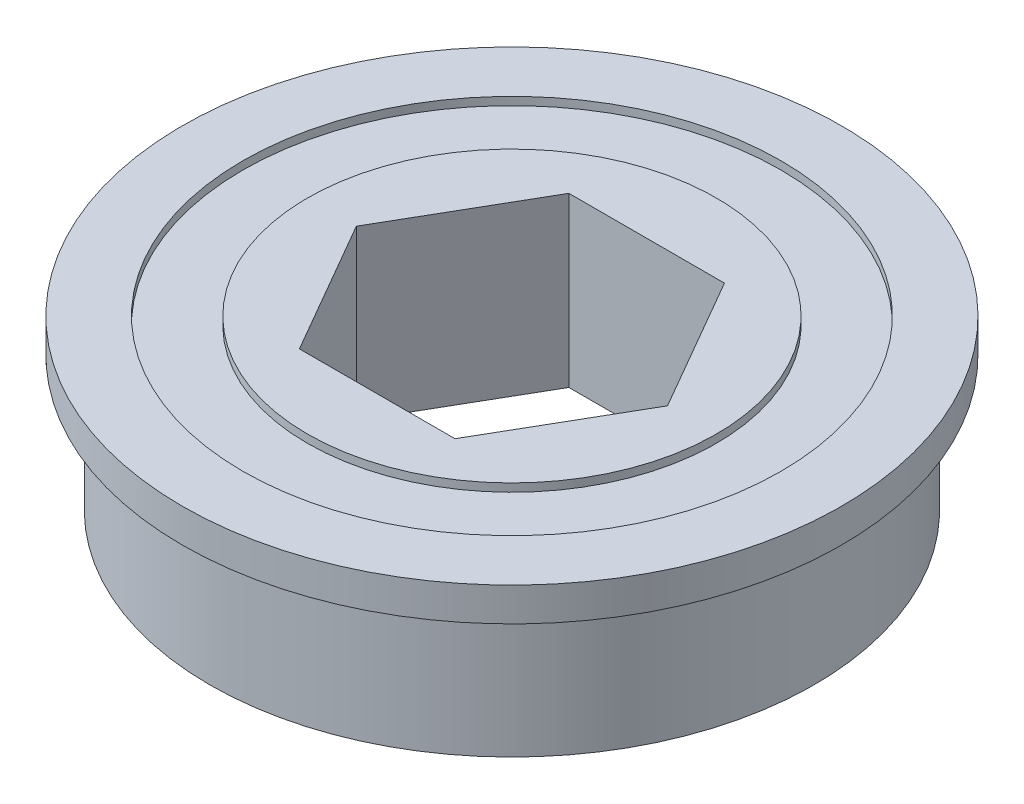
ISO-10303-21;
HEADER;
FILE_DESCRIPTION(('STEP AP214'),'2;1');
FILE_NAME('part.step','',(''),(''),'','','');
FILE_SCHEMA(('AUTOMOTIVE_DESIGN { 1 0 10303 214 1 1 1 1 }'));
ENDSEC;
DATA;
#1=APPLICATION_CONTEXT('core data for automotive mechanical design processes');
#2=APPLICATION_PROTOCOL_DEFINITION('international standard','automotive_design',2000,#1);
#3=PRODUCT_CONTEXT('',#1,'mechanical');
#4=PRODUCT('Part','Part','',(#3));
#5=PRODUCT_RELATED_PRODUCT_CATEGORY('part','',(#4));
#6=PRODUCT_DEFINITION_FORMATION('','',#4);
#7=PRODUCT_DEFINITION_CONTEXT('part definition',#1,'design');
#8=PRODUCT_DEFINITION('design','',#6,#7);
#9=PRODUCT_DEFINITION_SHAPE('','',#8);
#10=(LENGTH_UNIT() NAMED_UNIT(*) SI_UNIT(.MILLI.,.METRE.));
#11=(NAMED_UNIT(*) PLANE_ANGLE_UNIT() SI_UNIT($,.RADIAN.));
#12=(NAMED_UNIT(*) SI_UNIT($,.STERADIAN.) SOLID_ANGLE_UNIT());
#13=UNCERTAINTY_MEASURE_WITH_UNIT(LENGTH_MEASURE(1.E-05),#10,'distance_accuracy_value','');
#14=(GEOMETRIC_REPRESENTATION_CONTEXT(3) GLOBAL_UNCERTAINTY_ASSIGNED_CONTEXT((#13)) GLOBAL_UNIT_ASSIGNED_CONTEXT((#10,
#11,#12)) REPRESENTATION_CONTEXT('',''));
#15=CARTESIAN_POINT('',(0.,0.,0.));
#16=DIRECTION('',(0.,0.,1.));
#17=DIRECTION('',(1.,0.,0.));
#18=AXIS2_PLACEMENT_3D('',#15,#16,#17);
#19=CARTESIAN_POINT('',(0.,0.,0.));
#20=DIRECTION('',(0.,1.,0.));
#21=DIRECTION('',(0.,0.,1.));
#22=AXIS2_PLACEMENT_3D('',#19,#20,#21);
#23=CYLINDRICAL_SURFACE('',#22,9.652);
#24=CARTESIAN_POINT('',(0.,7.5565,0.));
#25=DIRECTION('',(0.,1.,0.));
#26=DIRECTION('',(0.,0.,1.));
#27=AXIS2_PLACEMENT_3D('',#24,#25,#26);
#28=CIRCLE('',#27,9.652);
#29=CARTESIAN_POINT('',(0.,7.5565,9.652));
#30=VERTEX_POINT('',#29);
#31=EDGE_CURVE('E10',#30,#30,#28,.T.);
#32=ORIENTED_EDGE('',*,*,#31,.T.);
#33=EDGE_LOOP('',(#32));
#34=FACE_BOUND('',#33,.T.);
#35=CARTESIAN_POINT('',(0.,7.9375,0.));
#36=DIRECTION('',(0.,1.,0.));
#37=DIRECTION('',(0.,0.,1.));
#38=AXIS2_PLACEMENT_3D('',#35,#36,#37);
#39=CIRCLE('',#38,9.652);
#40=CARTESIAN_POINT('',(0.,7.9375,9.652));
#41=VERTEX_POINT('',#40);
#42=EDGE_CURVE('E113',#41,#41,#39,.T.);
#43=ORIENTED_EDGE('',*,*,#42,.F.);
#44=EDGE_LOOP('',(#43));
#45=FACE_BOUND('',#44,.T.);
#46=ADVANCED_FACE('F16',(#34,#45),#23,.T.);
#47=CARTESIAN_POINT('',(9.652,7.5565,0.));
#48=DIRECTION('',(0.,1.,0.));
#49=DIRECTION('',(0.,0.,1.));
#50=AXIS2_PLACEMENT_3D('',#47,#48,#49);
#51=PLANE('',#50);
#52=CARTESIAN_POINT('',(0.,7.5565,0.));
#53=DIRECTION('',(0.,1.,0.));
#54=DIRECTION('',(0.,0.,1.));
#55=AXIS2_PLACEMENT_3D('',#52,#53,#54);
#56=CIRCLE('',#55,12.7);
#57=CARTESIAN_POINT('',(0.,7.5565,12.7));
#58=VERTEX_POINT('',#57);
#59=EDGE_CURVE('E23',#58,#58,#56,.T.);
#60=ORIENTED_EDGE('',*,*,#59,.T.);
#61=EDGE_LOOP('',(#60));
#62=FACE_BOUND('',#61,.T.);
#63=ORIENTED_EDGE('',*,*,#31,.F.);
#64=EDGE_LOOP('',(#63));
#65=FACE_BOUND('',#64,.T.);
#66=ADVANCED_FACE('F158',(#62,#65),#51,.T.);
#67=CARTESIAN_POINT('',(0.,0.,0.));
#68=DIRECTION('',(0.,1.,0.));
#69=DIRECTION('',(0.,0.,1.));
#70=AXIS2_PLACEMENT_3D('',#67,#68,#69);
#71=CYLINDRICAL_SURFACE('',#70,12.7);
#72=CARTESIAN_POINT('',(0.,7.9375,0.));
#73=DIRECTION('',(0.,1.,0.));
#74=DIRECTION('',(0.,0.,1.));
#75=AXIS2_PLACEMENT_3D('',#72,#73,#74);
#76=CIRCLE('',#75,12.7);
#77=CARTESIAN_POINT('',(0.,7.9375,12.7));
#78=VERTEX_POINT('',#77);
#79=EDGE_CURVE('E153',#78,#78,#76,.T.);
#80=ORIENTED_EDGE('',*,*,#79,.T.);
#81=EDGE_LOOP('',(#80));
#82=FACE_BOUND('',#81,.T.);
#83=ORIENTED_EDGE('',*,*,#59,.F.);
#84=EDGE_LOOP('',(#83));
#85=FACE_BOUND('',#84,.T.);
#86=ADVANCED_FACE('F161',(#82,#85),#71,.F.);
#87=CARTESIAN_POINT('',(12.7,7.9375,0.));
#88=DIRECTION('',(0.,1.,0.));
#89=DIRECTION('',(0.,0.,1.));
#90=AXIS2_PLACEMENT_3D('',#87,#88,#89);
#91=PLANE('',#90);
#92=CARTESIAN_POINT('',(0.,7.9375,0.));
#93=DIRECTION('',(0.,1.,0.));
#94=DIRECTION('',(0.,0.,1.));
#95=AXIS2_PLACEMENT_3D('',#92,#93,#94);
#96=CIRCLE('',#95,15.5575);
#97=CARTESIAN_POINT('',(0.,7.9375,15.5575));
#98=VERTEX_POINT('',#97);
#99=EDGE_CURVE('E150',#98,#98,#96,.T.);
#100=ORIENTED_EDGE('',*,*,#99,.T.);
#101=EDGE_LOOP('',(#100));
#102=FACE_BOUND('',#101,.T.);
#103=ORIENTED_EDGE('',*,*,#79,.F.);
#104=EDGE_LOOP('',(#103));
#105=FACE_BOUND('',#104,.T.);
#106=ADVANCED_FACE('F163',(#102,#105),#91,.T.);
#107=CARTESIAN_POINT('',(0.,0.,0.));
#108=DIRECTION('',(0.,1.,0.));
#109=DIRECTION('',(0.,0.,1.));
#110=AXIS2_PLACEMENT_3D('',#107,#108,#109);
#111=CYLINDRICAL_SURFACE('',#110,15.5575);
#112=CARTESIAN_POINT('',(0.,6.35,0.));
#113=DIRECTION('',(0.,1.,0.));
#114=DIRECTION('',(0.,0.,1.));
#115=AXIS2_PLACEMENT_3D('',#112,#113,#114);
#116=CIRCLE('',#115,15.5575);
#117=CARTESIAN_POINT('',(0.,6.35,15.5575));
#118=VERTEX_POINT('',#117);
#119=EDGE_CURVE('E147',#118,#118,#116,.T.);
#120=ORIENTED_EDGE('',*,*,#119,.T.);
#121=EDGE_LOOP('',(#120));
#122=FACE_BOUND('',#121,.T.);
#123=ORIENTED_EDGE('',*,*,#99,.F.);
#124=EDGE_LOOP('',(#123));
#125=FACE_BOUND('',#124,.T.);
#126=ADVANCED_FACE('F172',(#122,#125),#111,.T.);
#127=CARTESIAN_POINT('',(15.5575,6.35,0.));
#128=DIRECTION('',(0.,-1.,0.));
#129=DIRECTION('',(0.,0.,-1.));
#130=AXIS2_PLACEMENT_3D('',#127,#128,#129);
#131=PLANE('',#130);
#132=CARTESIAN_POINT('',(0.,6.35,0.));
#133=DIRECTION('',(0.,1.,0.));
#134=DIRECTION('',(0.,0.,1.));
#135=AXIS2_PLACEMENT_3D('',#132,#133,#134);
#136=CIRCLE('',#135,14.2748);
#137=CARTESIAN_POINT('',(0.,6.35,14.2748));
#138=VERTEX_POINT('',#137);
#139=EDGE_CURVE('E144',#138,#138,#136,.T.);
#140=ORIENTED_EDGE('',*,*,#139,.T.);
#141=EDGE_LOOP('',(#140));
#142=FACE_BOUND('',#141,.T.);
#143=ORIENTED_EDGE('',*,*,#119,.F.);
#144=EDGE_LOOP('',(#143));
#145=FACE_BOUND('',#144,.T.);
#146=ADVANCED_FACE('F226',(#142,#145),#131,.T.);
#147=CARTESIAN_POINT('',(0.,6.1,0.));
#148=DIRECTION('',(0.,1.,0.));
#149=DIRECTION('',(0.,0.,1.));
#150=AXIS2_PLACEMENT_3D('',#147,#148,#149);
#151=TOROIDAL_SURFACE('',#150,14.2748,0.25);
#152=CARTESIAN_POINT('',(0.,5.975,0.));
#153=DIRECTION('',(0.,1.,0.));
#154=DIRECTION('',(0.,0.,1.));
#155=AXIS2_PLACEMENT_3D('',#152,#153,#154);
#156=CIRCLE('',#155,14.0582936490539);
#157=CARTESIAN_POINT('',(0.,5.975,14.0582936490539));
#158=VERTEX_POINT('',#157);
#159=EDGE_CURVE('E141',#158,#158,#156,.T.);
#160=ORIENTED_EDGE('',*,*,#159,.T.);
#161=EDGE_LOOP('',(#160));
#162=FACE_BOUND('',#161,.T.);
#163=ORIENTED_EDGE('',*,*,#139,.F.);
#164=EDGE_LOOP('',(#163));
#165=FACE_BOUND('',#164,.T.);
#166=ADVANCED_FACE('F222',(#162,#165),#151,.F.);
#167=CARTESIAN_POINT('',(0.,5.975,0.));
#168=DIRECTION('',(0.,-1.,0.));
#169=DIRECTION('',(0.,0.,-1.));
#170=AXIS2_PLACEMENT_3D('',#167,#168,#169);
#171=CONICAL_SURFACE('',#170,14.0582936490539,0.523598775598298);
#172=CARTESIAN_POINT('',(0.,5.6,0.));
#173=DIRECTION('',(0.,1.,0.));
#174=DIRECTION('',(0.,0.,1.));
#175=AXIS2_PLACEMENT_3D('',#172,#173,#174);
#176=CIRCLE('',#175,14.2748);
#177=CARTESIAN_POINT('',(0.,5.6,14.2748));
#178=VERTEX_POINT('',#177);
#179=EDGE_CURVE('E138',#178,#178,#176,.T.);
#180=ORIENTED_EDGE('',*,*,#179,.T.);
#181=EDGE_LOOP('',(#180));
#182=FACE_BOUND('',#181,.T.);
#183=ORIENTED_EDGE('',*,*,#159,.F.);
#184=EDGE_LOOP('',(#183));
#185=FACE_BOUND('',#184,.T.);
#186=ADVANCED_FACE('F218',(#182,#185),#171,.T.);
#187=CARTESIAN_POINT('',(0.,0.,0.));
#188=DIRECTION('',(0.,1.,0.));
#189=DIRECTION('',(0.,0.,1.));
#190=AXIS2_PLACEMENT_3D('',#187,#188,#189);
#191=CYLINDRICAL_SURFACE('',#190,14.2748);
#192=CARTESIAN_POINT('',(0.,0.,0.));
#193=DIRECTION('',(0.,1.,0.));
#194=DIRECTION('',(0.,0.,1.));
#195=AXIS2_PLACEMENT_3D('',#192,#193,#194);
#196=CIRCLE('',#195,14.2748);
#197=CARTESIAN_POINT('',(0.,0.,14.2748));
#198=VERTEX_POINT('',#197);
#199=EDGE_CURVE('E135',#198,#198,#196,.T.);
#200=ORIENTED_EDGE('',*,*,#199,.T.);
#201=EDGE_LOOP('',(#200));
#202=FACE_BOUND('',#201,.T.);
#203=ORIENTED_EDGE('',*,*,#179,.F.);
#204=EDGE_LOOP('',(#203));
#205=FACE_BOUND('',#204,.T.);
#206=ADVANCED_FACE('F214',(#202,#205),#191,.T.);
#207=CARTESIAN_POINT('',(14.2748,0.,0.));
#208=DIRECTION('',(0.,-1.,0.));
#209=DIRECTION('',(0.,0.,-1.));
#210=AXIS2_PLACEMENT_3D('',#207,#208,#209);
#211=PLANE('',#210);
#212=CARTESIAN_POINT('',(0.,0.,0.));
#213=DIRECTION('',(0.,1.,0.));
#214=DIRECTION('',(0.,0.,1.));
#215=AXIS2_PLACEMENT_3D('',#212,#213,#214);
#216=CIRCLE('',#215,12.7);
#217=CARTESIAN_POINT('',(0.,0.,12.7));
#218=VERTEX_POINT('',#217);
#219=EDGE_CURVE('E132',#218,#218,#216,.T.);
#220=ORIENTED_EDGE('',*,*,#219,.T.);
#221=EDGE_LOOP('',(#220));
#222=FACE_BOUND('',#221,.T.);
#223=ORIENTED_EDGE('',*,*,#199,.F.);
#224=EDGE_LOOP('',(#223));
#225=FACE_BOUND('',#224,.T.);
#226=ADVANCED_FACE('F210',(#222,#225),#211,.T.);
#227=CARTESIAN_POINT('',(0.,0.,0.));
#228=DIRECTION('',(0.,1.,0.));
#229=DIRECTION('',(0.,0.,1.));
#230=AXIS2_PLACEMENT_3D('',#227,#228,#229);
#231=CYLINDRICAL_SURFACE('',#230,12.7);
#232=CARTESIAN_POINT('',(0.,0.381,0.));
#233=DIRECTION('',(0.,1.,0.));
#234=DIRECTION('',(0.,0.,1.));
#235=AXIS2_PLACEMENT_3D('',#232,#233,#234);
#236=CIRCLE('',#235,12.7);
#237=CARTESIAN_POINT('',(0.,0.381,12.7));
#238=VERTEX_POINT('',#237);
#239=EDGE_CURVE('E129',#238,#238,#236,.T.);
#240=ORIENTED_EDGE('',*,*,#239,.T.);
#241=EDGE_LOOP('',(#240));
#242=FACE_BOUND('',#241,.T.);
#243=ORIENTED_EDGE('',*,*,#219,.F.);
#244=EDGE_LOOP('',(#243));
#245=FACE_BOUND('',#244,.T.);
#246=ADVANCED_FACE('F206',(#242,#245),#231,.F.);
#247=CARTESIAN_POINT('',(9.652,0.381,0.));
#248=DIRECTION('',(0.,-1.,0.));
#249=DIRECTION('',(0.,0.,-1.));
#250=AXIS2_PLACEMENT_3D('',#247,#248,#249);
#251=PLANE('',#250);
#252=CARTESIAN_POINT('',(0.,0.381,0.));
#253=DIRECTION('',(0.,1.,0.));
#254=DIRECTION('',(0.,0.,1.));
#255=AXIS2_PLACEMENT_3D('',#252,#253,#254);
#256=CIRCLE('',#255,9.652);
#257=CARTESIAN_POINT('',(0.,0.381,9.652));
#258=VERTEX_POINT('',#257);
#259=EDGE_CURVE('E126',#258,#258,#256,.T.);
#260=ORIENTED_EDGE('',*,*,#259,.T.);
#261=EDGE_LOOP('',(#260));
#262=FACE_BOUND('',#261,.T.);
#263=ORIENTED_EDGE('',*,*,#239,.F.);
#264=EDGE_LOOP('',(#263));
#265=FACE_BOUND('',#264,.T.);
#266=ADVANCED_FACE('F202',(#262,#265),#251,.T.);
#267=CARTESIAN_POINT('',(0.,0.,0.));
#268=DIRECTION('',(0.,1.,0.));
#269=DIRECTION('',(0.,0.,1.));
#270=AXIS2_PLACEMENT_3D('',#267,#268,#269);
#271=CYLINDRICAL_SURFACE('',#270,9.652);
#272=CARTESIAN_POINT('',(0.,0.,0.));
#273=DIRECTION('',(0.,1.,0.));
#274=DIRECTION('',(0.,0.,1.));
#275=AXIS2_PLACEMENT_3D('',#272,#273,#274);
#276=CIRCLE('',#275,9.652);
#277=CARTESIAN_POINT('',(0.,0.,9.652));
#278=VERTEX_POINT('',#277);
#279=EDGE_CURVE('E123',#278,#278,#276,.T.);
#280=ORIENTED_EDGE('',*,*,#279,.T.);
#281=EDGE_LOOP('',(#280));
#282=FACE_BOUND('',#281,.T.);
#283=ORIENTED_EDGE('',*,*,#259,.F.);
#284=EDGE_LOOP('',(#283));
#285=FACE_BOUND('',#284,.T.);
#286=ADVANCED_FACE('F196',(#282,#285),#271,.T.);
#287=CARTESIAN_POINT('',(9.652,0.,0.));
#288=DIRECTION('',(0.,-1.,0.));
#289=DIRECTION('',(0.,0.,-1.));
#290=AXIS2_PLACEMENT_3D('',#287,#288,#289);
#291=PLANE('',#290);
#292=DIRECTION('',(-0.5,0.,-0.866025403784439));
#293=VECTOR('',#292,1.);
#294=CARTESIAN_POINT('',(7.34389542409204,0.,0.));
#295=LINE('',#294,#293);
#296=CARTESIAN_POINT('',(7.34389542409204,0.,0.));
#297=VERTEX_POINT('',#296);
#298=CARTESIAN_POINT('',(3.67194771204602,0.,-6.36));
#299=VERTEX_POINT('',#298);
#300=EDGE_CURVE('E70',#297,#299,#295,.T.);
#301=ORIENTED_EDGE('',*,*,#300,.T.);
#302=DIRECTION('',(-1.,0.,0.));
#303=VECTOR('',#302,1.);
#304=CARTESIAN_POINT('',(3.67194771204602,0.,-6.36));
#305=LINE('',#304,#303);
#306=CARTESIAN_POINT('',(-3.67194771204602,0.,-6.36));
#307=VERTEX_POINT('',#306);
#308=EDGE_CURVE('E79',#299,#307,#305,.T.);
#309=ORIENTED_EDGE('',*,*,#308,.T.);
#310=DIRECTION('',(-0.5,0.,0.866025403784439));
#311=VECTOR('',#310,1.);
#312=CARTESIAN_POINT('',(-3.67194771204602,0.,-6.36));
#313=LINE('',#312,#311);
#314=CARTESIAN_POINT('',(-7.34389542409204,0.,0.));
#315=VERTEX_POINT('',#314);
#316=EDGE_CURVE('E30',#307,#315,#313,.T.);
#317=ORIENTED_EDGE('',*,*,#316,.T.);
#318=DIRECTION('',(0.5,0.,0.866025403784439));
#319=VECTOR('',#318,1.);
#320=CARTESIAN_POINT('',(-7.34389542409204,0.,0.));
#321=LINE('',#320,#319);
#322=CARTESIAN_POINT('',(-3.67194771204601,0.,6.36));
#323=VERTEX_POINT('',#322);
#324=EDGE_CURVE('E94',#315,#323,#321,.T.);
#325=ORIENTED_EDGE('',*,*,#324,.T.);
#326=DIRECTION('',(1.,0.,0.));
#327=VECTOR('',#326,1.);
#328=CARTESIAN_POINT('',(-3.67194771204601,0.,6.36));
#329=LINE('',#328,#327);
#330=CARTESIAN_POINT('',(3.67194771204602,0.,6.36));
#331=VERTEX_POINT('',#330);
#332=EDGE_CURVE('E97',#323,#331,#329,.T.);
#333=ORIENTED_EDGE('',*,*,#332,.T.);
#334=DIRECTION('',(0.5,0.,-0.866025403784439));
#335=VECTOR('',#334,1.);
#336=CARTESIAN_POINT('',(3.67194771204602,0.,6.36));
#337=LINE('',#336,#335);
#338=EDGE_CURVE('E76',#331,#297,#337,.T.);
#339=ORIENTED_EDGE('',*,*,#338,.T.);
#340=EDGE_LOOP('',(#301,#309,#317,#325,#333,#339));
#341=FACE_BOUND('',#340,.T.);
#342=ORIENTED_EDGE('',*,*,#279,.F.);
#343=EDGE_LOOP('',(#342));
#344=FACE_BOUND('',#343,.T.);
#345=ADVANCED_FACE('F83',(#341,#344),#291,.T.);
#346=CARTESIAN_POINT('',(6.35,7.9375,0.));
#347=DIRECTION('',(0.,1.,0.));
#348=DIRECTION('',(0.,0.,1.));
#349=AXIS2_PLACEMENT_3D('',#346,#347,#348);
#350=PLANE('',#349);
#351=DIRECTION('',(-0.5,0.,-0.866025403784439));
#352=VECTOR('',#351,1.);
#353=CARTESIAN_POINT('',(7.34389542409204,7.9375,0.));
#354=LINE('',#353,#352);
#355=CARTESIAN_POINT('',(7.34389542409204,7.9375,0.));
#356=VERTEX_POINT('',#355);
#357=CARTESIAN_POINT('',(3.67194771204602,7.9375,-6.36));
#358=VERTEX_POINT('',#357);
#359=EDGE_CURVE('E38',#356,#358,#354,.T.);
#360=ORIENTED_EDGE('',*,*,#359,.F.);
#361=DIRECTION('',(0.5,0.,-0.866025403784439));
#362=VECTOR('',#361,1.);
#363=CARTESIAN_POINT('',(3.67194771204602,7.9375,6.36));
#364=LINE('',#363,#362);
#365=CARTESIAN_POINT('',(3.67194771204602,7.9375,6.36));
#366=VERTEX_POINT('',#365);
#367=EDGE_CURVE('E87',#366,#356,#364,.T.);
#368=ORIENTED_EDGE('',*,*,#367,.F.);
#369=DIRECTION('',(1.,0.,0.));
#370=VECTOR('',#369,1.);
#371=CARTESIAN_POINT('',(-3.67194771204601,7.9375,6.36));
#372=LINE('',#371,#370);
#373=CARTESIAN_POINT('',(-3.67194771204601,7.9375,6.36));
#374=VERTEX_POINT('',#373);
#375=EDGE_CURVE('E90',#374,#366,#372,.T.);
#376=ORIENTED_EDGE('',*,*,#375,.F.);
#377=DIRECTION('',(0.5,0.,0.866025403784439));
#378=VECTOR('',#377,1.);
#379=CARTESIAN_POINT('',(-7.34389542409204,7.9375,0.));
#380=LINE('',#379,#378);
#381=CARTESIAN_POINT('',(-7.34389542409204,7.9375,0.));
#382=VERTEX_POINT('',#381);
#383=EDGE_CURVE('E106',#382,#374,#380,.T.);
#384=ORIENTED_EDGE('',*,*,#383,.F.);
#385=DIRECTION('',(-0.5,0.,0.866025403784439));
#386=VECTOR('',#385,1.);
#387=CARTESIAN_POINT('',(-3.67194771204602,7.9375,-6.36));
#388=LINE('',#387,#386);
#389=CARTESIAN_POINT('',(-3.67194771204602,7.9375,-6.36));
#390=VERTEX_POINT('',#389);
#391=EDGE_CURVE('E103',#390,#382,#388,.T.);
#392=ORIENTED_EDGE('',*,*,#391,.F.);
#393=DIRECTION('',(-1.,0.,0.));
#394=VECTOR('',#393,1.);
#395=CARTESIAN_POINT('',(3.67194771204602,7.9375,-6.36));
#396=LINE('',#395,#394);
#397=EDGE_CURVE('E101',#358,#390,#396,.T.);
#398=ORIENTED_EDGE('',*,*,#397,.F.);
#399=EDGE_LOOP('',(#360,#368,#376,#384,#392,#398));
#400=FACE_BOUND('',#399,.T.);
#401=ORIENTED_EDGE('',*,*,#42,.T.);
#402=EDGE_LOOP('',(#401));
#403=FACE_BOUND('',#402,.T.);
#404=ADVANCED_FACE('F185',(#400,#403),#350,.T.);
#405=CARTESIAN_POINT('',(7.34389542409204,0.,0.));
#406=DIRECTION('',(0.866025403784439,0.,-0.5));
#407=DIRECTION('',(-0.5,0.,-0.866025403784439));
#408=AXIS2_PLACEMENT_3D('',#405,#406,#407);
#409=PLANE('',#408);
#410=ORIENTED_EDGE('',*,*,#359,.T.);
#411=DIRECTION('',(0.,1.,0.));
#412=VECTOR('',#411,1.);
#413=CARTESIAN_POINT('',(3.67194771204602,0.,-6.36));
#414=LINE('',#413,#412);
#415=EDGE_CURVE('E66',#299,#358,#414,.T.);
#416=ORIENTED_EDGE('',*,*,#415,.F.);
#417=ORIENTED_EDGE('',*,*,#300,.F.);
#418=DIRECTION('',(0.,1.,0.));
#419=VECTOR('',#418,1.);
#420=CARTESIAN_POINT('',(7.34389542409204,0.,0.));
#421=LINE('',#420,#419);
#422=EDGE_CURVE('E111',#297,#356,#421,.T.);
#423=ORIENTED_EDGE('',*,*,#422,.T.);
#424=EDGE_LOOP('',(#410,#416,#417,#423));
#425=FACE_BOUND('',#424,.T.);
#426=ADVANCED_FACE('F68',(#425),#409,.F.);
#427=CARTESIAN_POINT('',(3.67194771204602,0.,6.36));
#428=DIRECTION('',(0.866025403784439,0.,0.5));
#429=DIRECTION('',(0.5,0.,-0.866025403784439));
#430=AXIS2_PLACEMENT_3D('',#427,#428,#429);
#431=PLANE('',#430);
#432=ORIENTED_EDGE('',*,*,#367,.T.);
#433=ORIENTED_EDGE('',*,*,#422,.F.);
#434=ORIENTED_EDGE('',*,*,#338,.F.);
#435=DIRECTION('',(0.,1.,0.));
#436=VECTOR('',#435,1.);
#437=CARTESIAN_POINT('',(3.67194771204602,0.,6.36));
#438=LINE('',#437,#436);
#439=EDGE_CURVE('E114',#331,#366,#438,.T.);
#440=ORIENTED_EDGE('',*,*,#439,.T.);
#441=EDGE_LOOP('',(#432,#433,#434,#440));
#442=FACE_BOUND('',#441,.T.);
#443=ADVANCED_FACE('F194',(#442),#431,.F.);
#444=CARTESIAN_POINT('',(-3.67194771204601,0.,6.36));
#445=DIRECTION('',(0.,0.,1.));
#446=DIRECTION('',(1.,0.,0.));
#447=AXIS2_PLACEMENT_3D('',#444,#445,#446);
#448=PLANE('',#447);
#449=ORIENTED_EDGE('',*,*,#375,.T.);
#450=ORIENTED_EDGE('',*,*,#439,.F.);
#451=ORIENTED_EDGE('',*,*,#332,.F.);
#452=DIRECTION('',(0.,1.,0.));
#453=VECTOR('',#452,1.);
#454=CARTESIAN_POINT('',(-3.67194771204601,0.,6.36));
#455=LINE('',#454,#453);
#456=EDGE_CURVE('E116',#323,#374,#455,.T.);
#457=ORIENTED_EDGE('',*,*,#456,.T.);
#458=EDGE_LOOP('',(#449,#450,#451,#457));
#459=FACE_BOUND('',#458,.T.);
#460=ADVANCED_FACE('F372',(#459),#448,.F.);
#461=CARTESIAN_POINT('',(-7.34389542409204,0.,0.));
#462=DIRECTION('',(-0.866025403784439,0.,0.5));
#463=DIRECTION('',(0.5,0.,0.866025403784439));
#464=AXIS2_PLACEMENT_3D('',#461,#462,#463);
#465=PLANE('',#464);
#466=ORIENTED_EDGE('',*,*,#383,.T.);
#467=ORIENTED_EDGE('',*,*,#456,.F.);
#468=ORIENTED_EDGE('',*,*,#324,.F.);
#469=DIRECTION('',(0.,1.,0.));
#470=VECTOR('',#469,1.);
#471=CARTESIAN_POINT('',(-7.34389542409204,0.,0.));
#472=LINE('',#471,#470);
#473=EDGE_CURVE('E118',#315,#382,#472,.T.);
#474=ORIENTED_EDGE('',*,*,#473,.T.);
#475=EDGE_LOOP('',(#466,#467,#468,#474));
#476=FACE_BOUND('',#475,.T.);
#477=ADVANCED_FACE('F380',(#476),#465,.F.);
#478=CARTESIAN_POINT('',(-3.67194771204602,0.,-6.36));
#479=DIRECTION('',(-0.866025403784439,0.,-0.5));
#480=DIRECTION('',(-0.5,0.,0.866025403784439));
#481=AXIS2_PLACEMENT_3D('',#478,#479,#480);
#482=PLANE('',#481);
#483=ORIENTED_EDGE('',*,*,#391,.T.);
#484=ORIENTED_EDGE('',*,*,#473,.F.);
#485=ORIENTED_EDGE('',*,*,#316,.F.);
#486=DIRECTION('',(0.,1.,0.));
#487=VECTOR('',#486,1.);
#488=CARTESIAN_POINT('',(-3.67194771204602,0.,-6.36));
#489=LINE('',#488,#487);
#490=EDGE_CURVE('E75',#307,#390,#489,.T.);
#491=ORIENTED_EDGE('',*,*,#490,.T.);
#492=EDGE_LOOP('',(#483,#484,#485,#491));
#493=FACE_BOUND('',#492,.T.);
#494=ADVANCED_FACE('F389',(#493),#482,.F.);
#495=CARTESIAN_POINT('',(3.67194771204602,0.,-6.36));
#496=DIRECTION('',(0.,0.,-1.));
#497=DIRECTION('',(-1.,0.,0.));
#498=AXIS2_PLACEMENT_3D('',#495,#496,#497);
#499=PLANE('',#498);
#500=ORIENTED_EDGE('',*,*,#397,.T.);
#501=ORIENTED_EDGE('',*,*,#490,.F.);
#502=ORIENTED_EDGE('',*,*,#308,.F.);
#503=ORIENTED_EDGE('',*,*,#415,.T.);
#504=EDGE_LOOP('',(#500,#501,#502,#503));
#505=FACE_BOUND('',#504,.T.);
#506=ADVANCED_FACE('F80',(#505),#499,.F.);
#507=CLOSED_SHELL('',(#46,#66,#86,#106,#126,#146,#166,#186,#206,#226,#246,#266,#286,#345,#404,
#426,#443,#460,#477,#494,#506));
#508=MANIFOLD_SOLID_BREP('B1',#507);
#509=ADVANCED_BREP_SHAPE_REPRESENTATION('',(#18,#508),#14);
#510=SHAPE_DEFINITION_REPRESENTATION(#9,#509);
ENDSEC;
END-ISO-10303-21;
